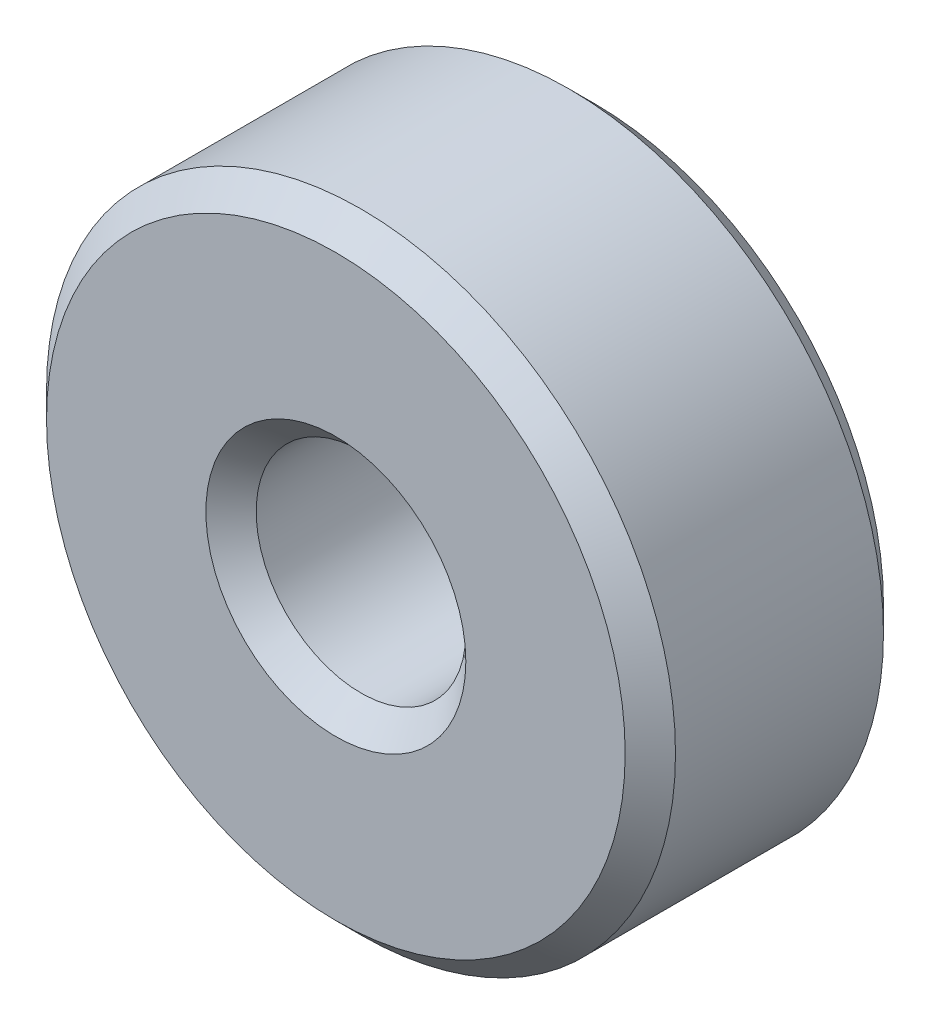
ISO-10303-21;
HEADER;
FILE_DESCRIPTION(('STEP AP214'),'2;1');
FILE_NAME('part.step','',(''),(''),'','','');
FILE_SCHEMA(('AUTOMOTIVE_DESIGN { 1 0 10303 214 1 1 1 1 }'));
ENDSEC;
DATA;
#1=APPLICATION_CONTEXT('core data for automotive mechanical design processes');
#2=APPLICATION_PROTOCOL_DEFINITION('international standard','automotive_design',2000,#1);
#3=PRODUCT_CONTEXT('',#1,'mechanical');
#4=PRODUCT('Part','Part','',(#3));
#5=PRODUCT_RELATED_PRODUCT_CATEGORY('part','',(#4));
#6=PRODUCT_DEFINITION_FORMATION('','',#4);
#7=PRODUCT_DEFINITION_CONTEXT('part definition',#1,'design');
#8=PRODUCT_DEFINITION('design','',#6,#7);
#9=PRODUCT_DEFINITION_SHAPE('','',#8);
#10=(LENGTH_UNIT() NAMED_UNIT(*) SI_UNIT(.MILLI.,.METRE.));
#11=(NAMED_UNIT(*) PLANE_ANGLE_UNIT() SI_UNIT($,.RADIAN.));
#12=(NAMED_UNIT(*) SI_UNIT($,.STERADIAN.) SOLID_ANGLE_UNIT());
#13=UNCERTAINTY_MEASURE_WITH_UNIT(LENGTH_MEASURE(1.E-05),#10,'distance_accuracy_value','');
#14=(GEOMETRIC_REPRESENTATION_CONTEXT(3) GLOBAL_UNCERTAINTY_ASSIGNED_CONTEXT((#13)) GLOBAL_UNIT_ASSIGNED_CONTEXT((#10,
#11,#12)) REPRESENTATION_CONTEXT('',''));
#15=CARTESIAN_POINT('',(0.,0.,0.));
#16=DIRECTION('',(0.,0.,1.));
#17=DIRECTION('',(1.,0.,0.));
#18=AXIS2_PLACEMENT_3D('',#15,#16,#17);
#19=CARTESIAN_POINT('',(0.,0.,3.9116));
#20=DIRECTION('',(0.,0.,1.));
#21=DIRECTION('',(1.,0.,0.));
#22=AXIS2_PLACEMENT_3D('',#19,#20,#21);
#23=PLANE('',#22);
#24=CARTESIAN_POINT('',(0.,0.,3.9116));
#25=DIRECTION('',(0.,0.,1.));
#26=DIRECTION('',(1.,0.,0.));
#27=AXIS2_PLACEMENT_3D('',#24,#25,#26);
#28=CIRCLE('',#27,4.3815);
#29=CARTESIAN_POINT('',(4.3815,0.,3.9116));
#30=VERTEX_POINT('',#29);
#31=EDGE_CURVE('E10',#30,#30,#28,.T.);
#32=ORIENTED_EDGE('',*,*,#31,.T.);
#33=EDGE_LOOP('',(#32));
#34=FACE_BOUND('',#33,.T.);
#35=CARTESIAN_POINT('',(0.,0.,3.9116));
#36=DIRECTION('',(0.,0.,1.));
#37=DIRECTION('',(1.,0.,0.));
#38=AXIS2_PLACEMENT_3D('',#35,#36,#37);
#39=CIRCLE('',#38,1.96850000000001);
#40=CARTESIAN_POINT('',(1.96850000000001,0.,3.9116));
#41=VERTEX_POINT('',#40);
#42=EDGE_CURVE('E40',#41,#41,#39,.F.);
#43=ORIENTED_EDGE('',*,*,#42,.T.);
#44=EDGE_LOOP('',(#43));
#45=FACE_BOUND('',#44,.T.);
#46=ADVANCED_FACE('F33',(#34,#45),#23,.T.);
#47=CARTESIAN_POINT('',(0.,0.,0.));
#48=DIRECTION('',(0.,0.,1.));
#49=DIRECTION('',(1.,0.,0.));
#50=AXIS2_PLACEMENT_3D('',#47,#48,#49);
#51=PLANE('',#50);
#52=CARTESIAN_POINT('',(0.,0.,0.));
#53=DIRECTION('',(0.,0.,1.));
#54=DIRECTION('',(1.,0.,0.));
#55=AXIS2_PLACEMENT_3D('',#52,#53,#54);
#56=CIRCLE('',#55,1.9685);
#57=CARTESIAN_POINT('',(1.9685,0.,0.));
#58=VERTEX_POINT('',#57);
#59=EDGE_CURVE('E59',#58,#58,#56,.T.);
#60=ORIENTED_EDGE('',*,*,#59,.T.);
#61=EDGE_LOOP('',(#60));
#62=FACE_BOUND('',#61,.T.);
#63=CARTESIAN_POINT('',(0.,0.,0.));
#64=DIRECTION('',(0.,0.,1.));
#65=DIRECTION('',(1.,0.,0.));
#66=AXIS2_PLACEMENT_3D('',#63,#64,#65);
#67=CIRCLE('',#66,4.3815);
#68=CARTESIAN_POINT('',(4.3815,0.,0.));
#69=VERTEX_POINT('',#68);
#70=EDGE_CURVE('E62',#69,#69,#67,.F.);
#71=ORIENTED_EDGE('',*,*,#70,.T.);
#72=EDGE_LOOP('',(#71));
#73=FACE_BOUND('',#72,.T.);
#74=ADVANCED_FACE('F66',(#62,#73),#51,.F.);
#75=CARTESIAN_POINT('',(0.,0.,3.9116));
#76=DIRECTION('',(0.,0.,-1.));
#77=DIRECTION('',(-1.,0.,0.));
#78=AXIS2_PLACEMENT_3D('',#75,#76,#77);
#79=CYLINDRICAL_SURFACE('',#78,4.7625);
#80=CARTESIAN_POINT('',(0.,0.,0.380999999999999));
#81=DIRECTION('',(0.,0.,1.));
#82=DIRECTION('',(1.,0.,0.));
#83=AXIS2_PLACEMENT_3D('',#80,#81,#82);
#84=CIRCLE('',#83,4.7625);
#85=CARTESIAN_POINT('',(4.7625,0.,0.380999999999999));
#86=VERTEX_POINT('',#85);
#87=EDGE_CURVE('E44',#86,#86,#84,.T.);
#88=ORIENTED_EDGE('',*,*,#87,.T.);
#89=EDGE_LOOP('',(#88));
#90=FACE_BOUND('',#89,.T.);
#91=CARTESIAN_POINT('',(0.,0.,3.5306));
#92=DIRECTION('',(0.,0.,1.));
#93=DIRECTION('',(1.,0.,0.));
#94=AXIS2_PLACEMENT_3D('',#91,#92,#93);
#95=CIRCLE('',#94,4.7625);
#96=CARTESIAN_POINT('',(4.7625,0.,3.5306));
#97=VERTEX_POINT('',#96);
#98=EDGE_CURVE('E48',#97,#97,#95,.F.);
#99=ORIENTED_EDGE('',*,*,#98,.T.);
#100=EDGE_LOOP('',(#99));
#101=FACE_BOUND('',#100,.T.);
#102=ADVANCED_FACE('F76',(#90,#101),#79,.T.);
#103=CARTESIAN_POINT('',(0.,0.,3.9116));
#104=DIRECTION('',(0.,0.,-1.));
#105=DIRECTION('',(-1.,0.,0.));
#106=AXIS2_PLACEMENT_3D('',#103,#104,#105);
#107=CYLINDRICAL_SURFACE('',#106,1.5875);
#108=CARTESIAN_POINT('',(0.,0.,0.381000000000001));
#109=DIRECTION('',(0.,0.,1.));
#110=DIRECTION('',(1.,0.,0.));
#111=AXIS2_PLACEMENT_3D('',#108,#109,#110);
#112=CIRCLE('',#111,1.5875);
#113=CARTESIAN_POINT('',(1.5875,0.,0.381000000000001));
#114=VERTEX_POINT('',#113);
#115=EDGE_CURVE('E53',#114,#114,#112,.F.);
#116=ORIENTED_EDGE('',*,*,#115,.T.);
#117=EDGE_LOOP('',(#116));
#118=FACE_BOUND('',#117,.T.);
#119=CARTESIAN_POINT('',(0.,0.,3.5306));
#120=DIRECTION('',(0.,0.,1.));
#121=DIRECTION('',(1.,0.,0.));
#122=AXIS2_PLACEMENT_3D('',#119,#120,#121);
#123=CIRCLE('',#122,1.5875);
#124=CARTESIAN_POINT('',(1.5875,0.,3.5306));
#125=VERTEX_POINT('',#124);
#126=EDGE_CURVE('E56',#125,#125,#123,.T.);
#127=ORIENTED_EDGE('',*,*,#126,.T.);
#128=EDGE_LOOP('',(#127));
#129=FACE_BOUND('',#128,.T.);
#130=ADVANCED_FACE('F79',(#118,#129),#107,.F.);
#131=CARTESIAN_POINT('',(0.,0.,0.));
#132=DIRECTION('',(0.,0.,-1.));
#133=DIRECTION('',(-1.,0.,0.));
#134=AXIS2_PLACEMENT_3D('',#131,#132,#133);
#135=CONICAL_SURFACE('',#134,1.9685,0.785398163397444);
#136=ORIENTED_EDGE('',*,*,#115,.F.);
#137=EDGE_LOOP('',(#136));
#138=FACE_BOUND('',#137,.T.);
#139=ORIENTED_EDGE('',*,*,#59,.F.);
#140=EDGE_LOOP('',(#139));
#141=FACE_BOUND('',#140,.T.);
#142=ADVANCED_FACE('F72',(#138,#141),#135,.F.);
#143=CARTESIAN_POINT('',(0.,0.,0.380999999999999));
#144=DIRECTION('',(0.,0.,1.));
#145=DIRECTION('',(1.,0.,0.));
#146=AXIS2_PLACEMENT_3D('',#143,#144,#145);
#147=CONICAL_SURFACE('',#146,4.7625,0.78539816339745);
#148=ORIENTED_EDGE('',*,*,#70,.F.);
#149=EDGE_LOOP('',(#148));
#150=FACE_BOUND('',#149,.T.);
#151=ORIENTED_EDGE('',*,*,#87,.F.);
#152=EDGE_LOOP('',(#151));
#153=FACE_BOUND('',#152,.T.);
#154=ADVANCED_FACE('F68',(#150,#153),#147,.T.);
#155=CARTESIAN_POINT('',(0.,0.,3.9116));
#156=DIRECTION('',(0.,0.,-1.));
#157=DIRECTION('',(-1.,0.,0.));
#158=AXIS2_PLACEMENT_3D('',#155,#156,#157);
#159=CONICAL_SURFACE('',#158,4.3815,0.785398163397446);
#160=ORIENTED_EDGE('',*,*,#98,.F.);
#161=EDGE_LOOP('',(#160));
#162=FACE_BOUND('',#161,.T.);
#163=ORIENTED_EDGE('',*,*,#31,.F.);
#164=EDGE_LOOP('',(#163));
#165=FACE_BOUND('',#164,.T.);
#166=ADVANCED_FACE('F71',(#162,#165),#159,.T.);
#167=CARTESIAN_POINT('',(0.,0.,3.5306));
#168=DIRECTION('',(0.,0.,1.));
#169=DIRECTION('',(1.,0.,0.));
#170=AXIS2_PLACEMENT_3D('',#167,#168,#169);
#171=CONICAL_SURFACE('',#170,1.5875,0.785398163397452);
#172=ORIENTED_EDGE('',*,*,#42,.F.);
#173=EDGE_LOOP('',(#172));
#174=FACE_BOUND('',#173,.T.);
#175=ORIENTED_EDGE('',*,*,#126,.F.);
#176=EDGE_LOOP('',(#175));
#177=FACE_BOUND('',#176,.T.);
#178=ADVANCED_FACE('F35',(#174,#177),#171,.F.);
#179=CLOSED_SHELL('',(#46,#74,#102,#130,#142,#154,#166,#178));
#180=MANIFOLD_SOLID_BREP('B2',#179);
#181=ADVANCED_BREP_SHAPE_REPRESENTATION('',(#18,#180),#14);
#182=SHAPE_DEFINITION_REPRESENTATION(#9,#181);
ENDSEC;
END-ISO-10303-21;
